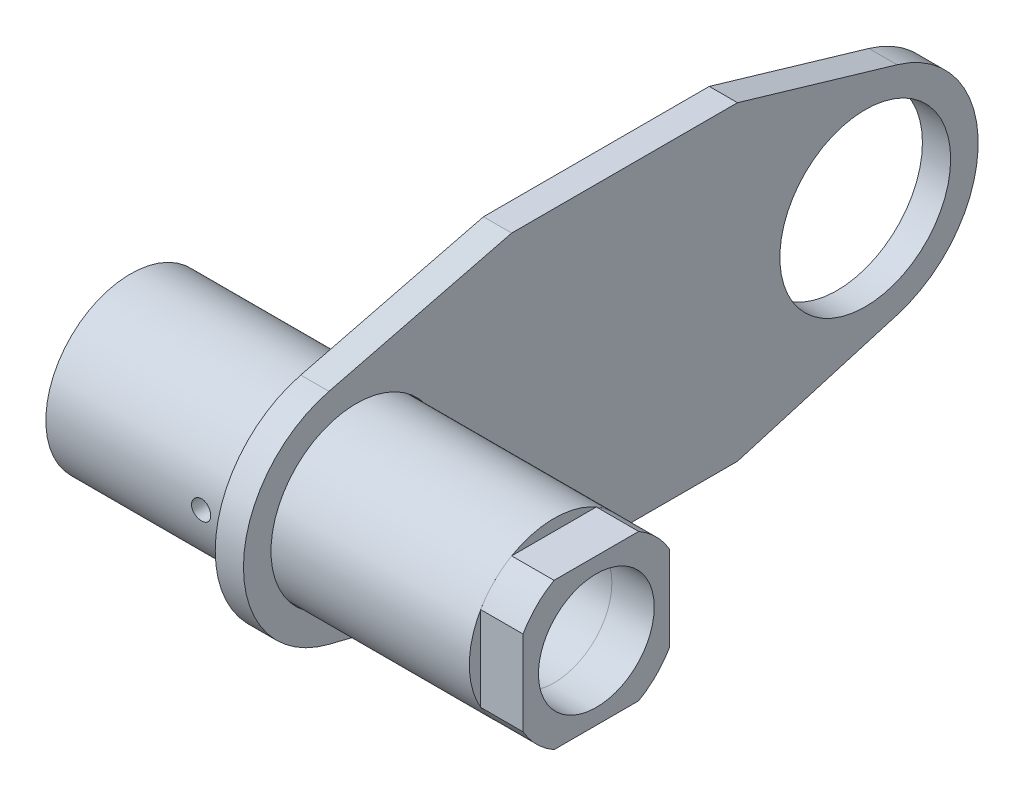
ISO-10303-21;
HEADER;
FILE_DESCRIPTION(('STEP AP214'),'2;1');
FILE_NAME('part.step','',(''),(''),'','','');
FILE_SCHEMA(('AUTOMOTIVE_DESIGN { 1 0 10303 214 1 1 1 1 }'));
ENDSEC;
DATA;
#1=APPLICATION_CONTEXT('core data for automotive mechanical design processes');
#2=APPLICATION_PROTOCOL_DEFINITION('international standard','automotive_design',2000,#1);
#3=PRODUCT_CONTEXT('',#1,'mechanical');
#4=PRODUCT('Part','Part','',(#3));
#5=PRODUCT_RELATED_PRODUCT_CATEGORY('part','',(#4));
#6=PRODUCT_DEFINITION_FORMATION('','',#4);
#7=PRODUCT_DEFINITION_CONTEXT('part definition',#1,'design');
#8=PRODUCT_DEFINITION('design','',#6,#7);
#9=PRODUCT_DEFINITION_SHAPE('','',#8);
#10=(LENGTH_UNIT() NAMED_UNIT(*) SI_UNIT(.MILLI.,.METRE.));
#11=(NAMED_UNIT(*) PLANE_ANGLE_UNIT() SI_UNIT($,.RADIAN.));
#12=(NAMED_UNIT(*) SI_UNIT($,.STERADIAN.) SOLID_ANGLE_UNIT());
#13=UNCERTAINTY_MEASURE_WITH_UNIT(LENGTH_MEASURE(1.E-05),#10,'distance_accuracy_value','');
#14=(GEOMETRIC_REPRESENTATION_CONTEXT(3) GLOBAL_UNCERTAINTY_ASSIGNED_CONTEXT((#13)) GLOBAL_UNIT_ASSIGNED_CONTEXT((#10,
#11,#12)) REPRESENTATION_CONTEXT('',''));
#15=CARTESIAN_POINT('',(0.,0.,0.));
#16=DIRECTION('',(0.,0.,1.));
#17=DIRECTION('',(1.,0.,0.));
#18=AXIS2_PLACEMENT_3D('',#15,#16,#17);
#19=CARTESIAN_POINT('',(-5.00000000000001,-87.1614510293032,-25.6310226888922));
#20=DIRECTION('',(0.,0.959379499066331,0.282118728146921));
#21=DIRECTION('',(0.,-0.282118728146921,0.959379499066331));
#22=AXIS2_PLACEMENT_3D('',#19,#20,#21);
#23=PLANE('',#22);
#24=DIRECTION('',(0.,-0.282118728146921,0.959379499066331));
#25=VECTOR('',#24,1.);
#26=CARTESIAN_POINT('',(4.99999999999999,-87.1614510293032,-25.6310226888922));
#27=LINE('',#26,#25);
#28=CARTESIAN_POINT('',(4.99999999999999,-38.3751799626532,-191.534749125877));
#29=VERTEX_POINT('',#28);
#30=CARTESIAN_POINT('',(4.99999999999999,-55.,-135.));
#31=VERTEX_POINT('',#30);
#32=EDGE_CURVE('E177',#29,#31,#27,.T.);
#33=ORIENTED_EDGE('',*,*,#32,.T.);
#34=DIRECTION('',(1.,0.,0.));
#35=VECTOR('',#34,1.);
#36=CARTESIAN_POINT('',(-5.00000000000001,-55.,-135.));
#37=LINE('',#36,#35);
#38=CARTESIAN_POINT('',(-5.00000000000001,-55.,-135.));
#39=VERTEX_POINT('',#38);
#40=EDGE_CURVE('E15',#39,#31,#37,.T.);
#41=ORIENTED_EDGE('',*,*,#40,.F.);
#42=DIRECTION('',(0.,-0.282118728146921,0.959379499066331));
#43=VECTOR('',#42,1.);
#44=CARTESIAN_POINT('',(-5.00000000000001,-87.1614510293032,-25.6310226888922));
#45=LINE('',#44,#43);
#46=CARTESIAN_POINT('',(-5.00000000000001,-38.3751799626532,-191.534749125877));
#47=VERTEX_POINT('',#46);
#48=EDGE_CURVE('E199',#47,#39,#45,.T.);
#49=ORIENTED_EDGE('',*,*,#48,.F.);
#50=DIRECTION('',(1.,0.,0.));
#51=VECTOR('',#50,1.);
#52=CARTESIAN_POINT('',(-5.00000000000001,-38.3751799626532,-191.534749125877));
#53=LINE('',#52,#51);
#54=EDGE_CURVE('E77',#47,#29,#53,.T.);
#55=ORIENTED_EDGE('',*,*,#54,.T.);
#56=EDGE_LOOP('',(#33,#41,#49,#55));
#57=FACE_BOUND('',#56,.T.);
#58=ADVANCED_FACE('F74',(#57),#23,.F.);
#59=CARTESIAN_POINT('',(-5.00000000000001,-55.,0.));
#60=DIRECTION('',(0.,1.,0.));
#61=DIRECTION('',(0.,0.,1.));
#62=AXIS2_PLACEMENT_3D('',#59,#60,#61);
#63=PLANE('',#62);
#64=DIRECTION('',(0.,0.,1.));
#65=VECTOR('',#64,1.);
#66=CARTESIAN_POINT('',(4.99999999999999,-55.,0.));
#67=LINE('',#66,#65);
#68=CARTESIAN_POINT('',(4.99999999999999,-55.,-55.));
#69=VERTEX_POINT('',#68);
#70=EDGE_CURVE('E117',#31,#69,#67,.T.);
#71=ORIENTED_EDGE('',*,*,#70,.T.);
#72=DIRECTION('',(1.,0.,0.));
#73=VECTOR('',#72,1.);
#74=CARTESIAN_POINT('',(-5.00000000000001,-55.,-55.));
#75=LINE('',#74,#73);
#76=CARTESIAN_POINT('',(-5.00000000000001,-55.,-55.));
#77=VERTEX_POINT('',#76);
#78=EDGE_CURVE('E83',#77,#69,#75,.T.);
#79=ORIENTED_EDGE('',*,*,#78,.F.);
#80=DIRECTION('',(0.,0.,1.));
#81=VECTOR('',#80,1.);
#82=CARTESIAN_POINT('',(-5.00000000000001,-55.,0.));
#83=LINE('',#82,#81);
#84=EDGE_CURVE('E91',#39,#77,#83,.T.);
#85=ORIENTED_EDGE('',*,*,#84,.F.);
#86=ORIENTED_EDGE('',*,*,#40,.T.);
#87=EDGE_LOOP('',(#71,#79,#85,#86));
#88=FACE_BOUND('',#87,.T.);
#89=ADVANCED_FACE('F231',(#88),#63,.F.);
#90=CARTESIAN_POINT('',(-5.00000000000001,-38.8030255711388,9.7121164802297));
#91=DIRECTION('',(0.,0.97007563927847,-0.242802912005743));
#92=DIRECTION('',(0.,0.242802912005743,0.97007563927847));
#93=AXIS2_PLACEMENT_3D('',#90,#91,#92);
#94=PLANE('',#93);
#95=DIRECTION('',(0.,0.242802912005743,0.97007563927847));
#96=VECTOR('',#95,1.);
#97=CARTESIAN_POINT('',(4.99999999999999,-38.8030255711388,9.7121164802297));
#98=LINE('',#97,#96);
#99=CARTESIAN_POINT('',(4.99999999999999,-38.8030255711388,9.71211648022971));
#100=VERTEX_POINT('',#99);
#101=EDGE_CURVE('E156',#69,#100,#98,.T.);
#102=ORIENTED_EDGE('',*,*,#101,.T.);
#103=DIRECTION('',(1.,0.,0.));
#104=VECTOR('',#103,1.);
#105=CARTESIAN_POINT('',(-5.00000000000001,-38.8030255711388,9.71211648022971));
#106=LINE('',#105,#104);
#107=CARTESIAN_POINT('',(-5.00000000000001,-38.8030255711388,9.71211648022971));
#108=VERTEX_POINT('',#107);
#109=EDGE_CURVE('E154',#108,#100,#106,.T.);
#110=ORIENTED_EDGE('',*,*,#109,.F.);
#111=DIRECTION('',(0.,0.242802912005743,0.97007563927847));
#112=VECTOR('',#111,1.);
#113=CARTESIAN_POINT('',(-5.00000000000001,-38.8030255711388,9.7121164802297));
#114=LINE('',#113,#112);
#115=EDGE_CURVE('E145',#77,#108,#114,.T.);
#116=ORIENTED_EDGE('',*,*,#115,.F.);
#117=ORIENTED_EDGE('',*,*,#78,.T.);
#118=EDGE_LOOP('',(#102,#110,#116,#117));
#119=FACE_BOUND('',#118,.T.);
#120=ADVANCED_FACE('F155',(#119),#94,.F.);
#121=CARTESIAN_POINT('',(-5.00000000000001,0.,0.));
#122=DIRECTION('',(1.,0.,0.));
#123=DIRECTION('',(0.,0.,-1.));
#124=AXIS2_PLACEMENT_3D('',#121,#122,#123);
#125=CYLINDRICAL_SURFACE('',#124,40.);
#126=CARTESIAN_POINT('',(4.99999999999999,0.,0.));
#127=DIRECTION('',(1.,0.,0.));
#128=DIRECTION('',(0.,0.,-1.));
#129=AXIS2_PLACEMENT_3D('',#126,#127,#128);
#130=CIRCLE('',#129,40.);
#131=CARTESIAN_POINT('',(4.99999999999999,38.8030255711388,9.71211648022971));
#132=VERTEX_POINT('',#131);
#133=EDGE_CURVE('E190',#132,#100,#130,.T.);
#134=ORIENTED_EDGE('',*,*,#133,.F.);
#135=DIRECTION('',(1.,0.,0.));
#136=VECTOR('',#135,1.);
#137=CARTESIAN_POINT('',(-5.00000000000001,38.8030255711388,9.71211648022971));
#138=LINE('',#137,#136);
#139=CARTESIAN_POINT('',(-5.00000000000001,38.8030255711388,9.71211648022971));
#140=VERTEX_POINT('',#139);
#141=EDGE_CURVE('E160',#140,#132,#138,.T.);
#142=ORIENTED_EDGE('',*,*,#141,.F.);
#143=CARTESIAN_POINT('',(-5.00000000000001,0.,0.));
#144=DIRECTION('',(1.,0.,0.));
#145=DIRECTION('',(0.,0.,-1.));
#146=AXIS2_PLACEMENT_3D('',#143,#144,#145);
#147=CIRCLE('',#146,40.);
#148=EDGE_CURVE('E150',#140,#108,#147,.T.);
#149=ORIENTED_EDGE('',*,*,#148,.T.);
#150=ORIENTED_EDGE('',*,*,#109,.T.);
#151=EDGE_LOOP('',(#134,#142,#149,#150));
#152=FACE_BOUND('',#151,.T.);
#153=ADVANCED_FACE('F162',(#152),#125,.T.);
#154=CARTESIAN_POINT('',(-5.00000000000001,38.8030255711388,9.71211648022971));
#155=DIRECTION('',(0.,-0.97007563927847,-0.242802912005743));
#156=DIRECTION('',(0.,0.242802912005743,-0.97007563927847));
#157=AXIS2_PLACEMENT_3D('',#154,#155,#156);
#158=PLANE('',#157);
#159=DIRECTION('',(0.,0.242802912005743,-0.97007563927847));
#160=VECTOR('',#159,1.);
#161=CARTESIAN_POINT('',(4.99999999999999,38.8030255711388,9.71211648022971));
#162=LINE('',#161,#160);
#163=CARTESIAN_POINT('',(4.99999999999999,55.,-55.));
#164=VERTEX_POINT('',#163);
#165=EDGE_CURVE('E188',#132,#164,#162,.T.);
#166=ORIENTED_EDGE('',*,*,#165,.T.);
#167=DIRECTION('',(1.,0.,0.));
#168=VECTOR('',#167,1.);
#169=CARTESIAN_POINT('',(-5.00000000000001,55.,-55.));
#170=LINE('',#169,#168);
#171=CARTESIAN_POINT('',(-5.00000000000001,55.,-55.));
#172=VERTEX_POINT('',#171);
#173=EDGE_CURVE('E203',#172,#164,#170,.T.);
#174=ORIENTED_EDGE('',*,*,#173,.F.);
#175=DIRECTION('',(0.,0.242802912005743,-0.97007563927847));
#176=VECTOR('',#175,1.);
#177=CARTESIAN_POINT('',(-5.00000000000001,38.8030255711388,9.71211648022971));
#178=LINE('',#177,#176);
#179=EDGE_CURVE('E164',#140,#172,#178,.T.);
#180=ORIENTED_EDGE('',*,*,#179,.F.);
#181=ORIENTED_EDGE('',*,*,#141,.T.);
#182=EDGE_LOOP('',(#166,#174,#180,#181));
#183=FACE_BOUND('',#182,.T.);
#184=ADVANCED_FACE('F243',(#183),#158,.F.);
#185=CARTESIAN_POINT('',(-5.00000000000001,55.,0.));
#186=DIRECTION('',(0.,-1.,0.));
#187=DIRECTION('',(0.,0.,-1.));
#188=AXIS2_PLACEMENT_3D('',#185,#186,#187);
#189=PLANE('',#188);
#190=DIRECTION('',(0.,0.,-1.));
#191=VECTOR('',#190,1.);
#192=CARTESIAN_POINT('',(4.99999999999999,55.,0.));
#193=LINE('',#192,#191);
#194=CARTESIAN_POINT('',(4.99999999999999,55.,-135.));
#195=VERTEX_POINT('',#194);
#196=EDGE_CURVE('E186',#164,#195,#193,.T.);
#197=ORIENTED_EDGE('',*,*,#196,.T.);
#198=DIRECTION('',(1.,0.,0.));
#199=VECTOR('',#198,1.);
#200=CARTESIAN_POINT('',(-5.00000000000001,55.,-135.));
#201=LINE('',#200,#199);
#202=CARTESIAN_POINT('',(-5.00000000000001,55.,-135.));
#203=VERTEX_POINT('',#202);
#204=EDGE_CURVE('E206',#203,#195,#201,.T.);
#205=ORIENTED_EDGE('',*,*,#204,.F.);
#206=DIRECTION('',(0.,0.,-1.));
#207=VECTOR('',#206,1.);
#208=CARTESIAN_POINT('',(-5.00000000000001,55.,0.));
#209=LINE('',#208,#207);
#210=EDGE_CURVE('E166',#172,#203,#209,.T.);
#211=ORIENTED_EDGE('',*,*,#210,.F.);
#212=ORIENTED_EDGE('',*,*,#173,.T.);
#213=EDGE_LOOP('',(#197,#205,#211,#212));
#214=FACE_BOUND('',#213,.T.);
#215=ADVANCED_FACE('F246',(#214),#189,.F.);
#216=CARTESIAN_POINT('',(-5.00000000000001,87.1614510293032,-25.6310226888923));
#217=DIRECTION('',(0.,-0.959379499066331,0.282118728146921));
#218=DIRECTION('',(0.,-0.282118728146921,-0.959379499066331));
#219=AXIS2_PLACEMENT_3D('',#216,#217,#218);
#220=PLANE('',#219);
#221=DIRECTION('',(0.,-0.282118728146921,-0.959379499066331));
#222=VECTOR('',#221,1.);
#223=CARTESIAN_POINT('',(4.99999999999999,87.1614510293032,-25.6310226888923));
#224=LINE('',#223,#222);
#225=CARTESIAN_POINT('',(4.99999999999999,38.3751799626532,-191.534749125877));
#226=VERTEX_POINT('',#225);
#227=EDGE_CURVE('E183',#195,#226,#224,.T.);
#228=ORIENTED_EDGE('',*,*,#227,.T.);
#229=DIRECTION('',(1.,0.,0.));
#230=VECTOR('',#229,1.);
#231=CARTESIAN_POINT('',(-5.00000000000001,38.3751799626532,-191.534749125877));
#232=LINE('',#231,#230);
#233=CARTESIAN_POINT('',(-5.00000000000001,38.3751799626532,-191.534749125877));
#234=VERTEX_POINT('',#233);
#235=EDGE_CURVE('E208',#234,#226,#232,.T.);
#236=ORIENTED_EDGE('',*,*,#235,.F.);
#237=DIRECTION('',(0.,-0.282118728146921,-0.959379499066331));
#238=VECTOR('',#237,1.);
#239=CARTESIAN_POINT('',(-5.00000000000001,87.1614510293032,-25.6310226888923));
#240=LINE('',#239,#238);
#241=EDGE_CURVE('E260',#203,#234,#240,.T.);
#242=ORIENTED_EDGE('',*,*,#241,.F.);
#243=ORIENTED_EDGE('',*,*,#204,.T.);
#244=EDGE_LOOP('',(#228,#236,#242,#243));
#245=FACE_BOUND('',#244,.T.);
#246=ADVANCED_FACE('F226',(#245),#220,.F.);
#247=CARTESIAN_POINT('',(-5.00000000000001,0.,0.));
#248=DIRECTION('',(1.,0.,0.));
#249=DIRECTION('',(0.,0.,-1.));
#250=AXIS2_PLACEMENT_3D('',#247,#248,#249);
#251=CYLINDRICAL_SURFACE('',#250,30.25);
#252=CARTESIAN_POINT('',(-5.00000000000001,0.,0.));
#253=DIRECTION('',(1.,0.,0.));
#254=DIRECTION('',(0.,0.,-1.));
#255=AXIS2_PLACEMENT_3D('',#252,#253,#254);
#256=CIRCLE('',#255,30.25);
#257=CARTESIAN_POINT('',(-5.00000000000001,0.,-30.25));
#258=VERTEX_POINT('',#257);
#259=EDGE_CURVE('E171',#258,#258,#256,.F.);
#260=ORIENTED_EDGE('',*,*,#259,.T.);
#261=EDGE_LOOP('',(#260));
#262=FACE_BOUND('',#261,.T.);
#263=CARTESIAN_POINT('',(4.99999999999999,0.,0.));
#264=DIRECTION('',(1.,0.,0.));
#265=DIRECTION('',(0.,0.,-1.));
#266=AXIS2_PLACEMENT_3D('',#263,#264,#265);
#267=CIRCLE('',#266,30.25);
#268=CARTESIAN_POINT('',(4.99999999999999,0.,-30.25));
#269=VERTEX_POINT('',#268);
#270=EDGE_CURVE('E194',#269,#269,#267,.F.);
#271=ORIENTED_EDGE('',*,*,#270,.F.);
#272=EDGE_LOOP('',(#271));
#273=FACE_BOUND('',#272,.T.);
#274=ADVANCED_FACE('F219',(#262,#273),#251,.F.);
#275=CARTESIAN_POINT('',(-5.00000000000001,0.,-180.25));
#276=DIRECTION('',(1.,0.,0.));
#277=DIRECTION('',(0.,0.,-1.));
#278=AXIS2_PLACEMENT_3D('',#275,#276,#277);
#279=CYLINDRICAL_SURFACE('',#278,40.);
#280=CARTESIAN_POINT('',(4.99999999999999,0.,-180.25));
#281=DIRECTION('',(1.,0.,0.));
#282=DIRECTION('',(0.,0.,-1.));
#283=AXIS2_PLACEMENT_3D('',#280,#281,#282);
#284=CIRCLE('',#283,40.);
#285=EDGE_CURVE('E180',#29,#226,#284,.T.);
#286=ORIENTED_EDGE('',*,*,#285,.F.);
#287=ORIENTED_EDGE('',*,*,#54,.F.);
#288=CARTESIAN_POINT('',(-5.00000000000001,0.,-180.25));
#289=DIRECTION('',(1.,0.,0.));
#290=DIRECTION('',(0.,0.,-1.));
#291=AXIS2_PLACEMENT_3D('',#288,#289,#290);
#292=CIRCLE('',#291,40.);
#293=EDGE_CURVE('E261',#47,#234,#292,.T.);
#294=ORIENTED_EDGE('',*,*,#293,.T.);
#295=ORIENTED_EDGE('',*,*,#235,.T.);
#296=EDGE_LOOP('',(#286,#287,#294,#295));
#297=FACE_BOUND('',#296,.T.);
#298=ADVANCED_FACE('F216',(#297),#279,.T.);
#299=CARTESIAN_POINT('',(-5.00000000000001,0.,-180.25));
#300=DIRECTION('',(1.,0.,0.));
#301=DIRECTION('',(0.,0.,-1.));
#302=AXIS2_PLACEMENT_3D('',#299,#300,#301);
#303=CYLINDRICAL_SURFACE('',#302,30.25);
#304=CARTESIAN_POINT('',(-5.00000000000001,0.,-180.25));
#305=DIRECTION('',(1.,0.,0.));
#306=DIRECTION('',(0.,0.,-1.));
#307=AXIS2_PLACEMENT_3D('',#304,#305,#306);
#308=CIRCLE('',#307,30.25);
#309=CARTESIAN_POINT('',(-5.00000000000001,0.,-210.5));
#310=VERTEX_POINT('',#309);
#311=EDGE_CURVE('E174',#310,#310,#308,.T.);
#312=ORIENTED_EDGE('',*,*,#311,.F.);
#313=EDGE_LOOP('',(#312));
#314=FACE_BOUND('',#313,.T.);
#315=CARTESIAN_POINT('',(4.99999999999999,0.,-180.25));
#316=DIRECTION('',(1.,0.,0.));
#317=DIRECTION('',(0.,0.,-1.));
#318=AXIS2_PLACEMENT_3D('',#315,#316,#317);
#319=CIRCLE('',#318,30.25);
#320=CARTESIAN_POINT('',(4.99999999999999,0.,-210.5));
#321=VERTEX_POINT('',#320);
#322=EDGE_CURVE('E197',#321,#321,#319,.T.);
#323=ORIENTED_EDGE('',*,*,#322,.T.);
#324=EDGE_LOOP('',(#323));
#325=FACE_BOUND('',#324,.T.);
#326=ADVANCED_FACE('F218',(#314,#325),#303,.F.);
#327=CARTESIAN_POINT('',(-5.00000000000001,0.,0.));
#328=DIRECTION('',(1.,0.,0.));
#329=DIRECTION('',(0.,0.,-1.));
#330=AXIS2_PLACEMENT_3D('',#327,#328,#329);
#331=PLANE('',#330);
#332=ORIENTED_EDGE('',*,*,#48,.T.);
#333=ORIENTED_EDGE('',*,*,#84,.T.);
#334=ORIENTED_EDGE('',*,*,#115,.T.);
#335=ORIENTED_EDGE('',*,*,#148,.F.);
#336=ORIENTED_EDGE('',*,*,#179,.T.);
#337=ORIENTED_EDGE('',*,*,#210,.T.);
#338=ORIENTED_EDGE('',*,*,#241,.T.);
#339=ORIENTED_EDGE('',*,*,#293,.F.);
#340=EDGE_LOOP('',(#332,#333,#334,#335,#336,#337,#338,#339));
#341=FACE_BOUND('',#340,.T.);
#342=ORIENTED_EDGE('',*,*,#259,.F.);
#343=EDGE_LOOP('',(#342));
#344=FACE_BOUND('',#343,.T.);
#345=ORIENTED_EDGE('',*,*,#311,.T.);
#346=EDGE_LOOP('',(#345));
#347=FACE_BOUND('',#346,.T.);
#348=ADVANCED_FACE('F147',(#341,#344,#347),#331,.F.);
#349=CARTESIAN_POINT('',(4.99999999999999,0.,0.));
#350=DIRECTION('',(1.,0.,0.));
#351=DIRECTION('',(0.,0.,-1.));
#352=AXIS2_PLACEMENT_3D('',#349,#350,#351);
#353=PLANE('',#352);
#354=ORIENTED_EDGE('',*,*,#32,.F.);
#355=ORIENTED_EDGE('',*,*,#285,.T.);
#356=ORIENTED_EDGE('',*,*,#227,.F.);
#357=ORIENTED_EDGE('',*,*,#196,.F.);
#358=ORIENTED_EDGE('',*,*,#165,.F.);
#359=ORIENTED_EDGE('',*,*,#133,.T.);
#360=ORIENTED_EDGE('',*,*,#101,.F.);
#361=ORIENTED_EDGE('',*,*,#70,.F.);
#362=EDGE_LOOP('',(#354,#355,#356,#357,#358,#359,#360,#361));
#363=FACE_BOUND('',#362,.T.);
#364=ORIENTED_EDGE('',*,*,#270,.T.);
#365=EDGE_LOOP('',(#364));
#366=FACE_BOUND('',#365,.T.);
#367=ORIENTED_EDGE('',*,*,#322,.F.);
#368=EDGE_LOOP('',(#367));
#369=FACE_BOUND('',#368,.T.);
#370=ADVANCED_FACE('F213',(#363,#366,#369),#353,.T.);
#371=CLOSED_SHELL('',(#58,#89,#120,#153,#184,#215,#246,#274,#298,#326,#348,#370));
#372=MANIFOLD_SOLID_BREP('B2',#371);
#373=CARTESIAN_POINT('',(90.,0.,0.));
#374=DIRECTION('',(-1.,0.,0.));
#375=DIRECTION('',(0.,0.,1.));
#376=AXIS2_PLACEMENT_3D('',#373,#374,#375);
#377=CYLINDRICAL_SURFACE('',#376,30.);
#378=CARTESIAN_POINT('',(75.,0.,0.));
#379=DIRECTION('',(1.,0.,0.));
#380=DIRECTION('',(0.,0.,-1.));
#381=AXIS2_PLACEMENT_3D('',#378,#379,#380);
#382=CIRCLE('',#381,30.);
#383=CARTESIAN_POINT('',(75.,-25.9807621135332,-15.));
#384=VERTEX_POINT('',#383);
#385=CARTESIAN_POINT('',(75.,-15.,-25.9807621135332));
#386=VERTEX_POINT('',#385);
#387=EDGE_CURVE('E490',#384,#386,#382,.T.);
#388=ORIENTED_EDGE('',*,*,#387,.T.);
#389=DIRECTION('',(-1.,0.,0.));
#390=VECTOR('',#389,1.);
#391=CARTESIAN_POINT('',(90.,-15.,-25.9807621135332));
#392=LINE('',#391,#390);
#393=CARTESIAN_POINT('',(90.,-15.,-25.9807621135332));
#394=VERTEX_POINT('',#393);
#395=EDGE_CURVE('E72',#394,#386,#392,.T.);
#396=ORIENTED_EDGE('',*,*,#395,.F.);
#397=CARTESIAN_POINT('',(90.,0.,0.));
#398=DIRECTION('',(1.,0.,0.));
#399=DIRECTION('',(0.,0.,-1.));
#400=AXIS2_PLACEMENT_3D('',#397,#398,#399);
#401=CIRCLE('',#400,30.);
#402=CARTESIAN_POINT('',(90.,-25.9807621135332,-15.));
#403=VERTEX_POINT('',#402);
#404=EDGE_CURVE('E470',#403,#394,#401,.T.);
#405=ORIENTED_EDGE('',*,*,#404,.F.);
#406=DIRECTION('',(-1.,0.,0.));
#407=VECTOR('',#406,1.);
#408=CARTESIAN_POINT('',(90.,-25.9807621135332,-15.));
#409=LINE('',#408,#407);
#410=EDGE_CURVE('E471',#403,#384,#409,.T.);
#411=ORIENTED_EDGE('',*,*,#410,.T.);
#412=EDGE_LOOP('',(#388,#396,#405,#411));
#413=FACE_BOUND('',#412,.T.);
#414=ADVANCED_FACE('F376',(#413),#377,.T.);
#415=CARTESIAN_POINT('',(90.,0.,-25.9807621135332));
#416=DIRECTION('',(0.,0.,1.));
#417=DIRECTION('',(1.,0.,0.));
#418=AXIS2_PLACEMENT_3D('',#415,#416,#417);
#419=PLANE('',#418);
#420=DIRECTION('',(0.,1.,0.));
#421=VECTOR('',#420,1.);
#422=CARTESIAN_POINT('',(75.,0.,-25.9807621135332));
#423=LINE('',#422,#421);
#424=CARTESIAN_POINT('',(75.,15.,-25.9807621135332));
#425=VERTEX_POINT('',#424);
#426=EDGE_CURVE('E493',#386,#425,#423,.T.);
#427=ORIENTED_EDGE('',*,*,#426,.T.);
#428=DIRECTION('',(-1.,0.,0.));
#429=VECTOR('',#428,1.);
#430=CARTESIAN_POINT('',(90.,15.,-25.9807621135332));
#431=LINE('',#430,#429);
#432=CARTESIAN_POINT('',(90.,15.,-25.9807621135332));
#433=VERTEX_POINT('',#432);
#434=EDGE_CURVE('E385',#433,#425,#431,.T.);
#435=ORIENTED_EDGE('',*,*,#434,.F.);
#436=DIRECTION('',(0.,1.,0.));
#437=VECTOR('',#436,1.);
#438=CARTESIAN_POINT('',(90.,0.,-25.9807621135332));
#439=LINE('',#438,#437);
#440=EDGE_CURVE('E436',#394,#433,#439,.T.);
#441=ORIENTED_EDGE('',*,*,#440,.F.);
#442=ORIENTED_EDGE('',*,*,#395,.T.);
#443=EDGE_LOOP('',(#427,#435,#441,#442));
#444=FACE_BOUND('',#443,.T.);
#445=ADVANCED_FACE('F534',(#444),#419,.F.);
#446=CARTESIAN_POINT('',(75.,25.9807621135332,-15.));
#447=VERTEX_POINT('',#446);
#448=EDGE_CURVE('E494',#425,#447,#382,.T.);
#449=ORIENTED_EDGE('',*,*,#448,.T.);
#450=DIRECTION('',(-1.,0.,0.));
#451=VECTOR('',#450,1.);
#452=CARTESIAN_POINT('',(90.,25.9807621135332,-15.));
#453=LINE('',#452,#451);
#454=CARTESIAN_POINT('',(90.,25.9807621135332,-15.));
#455=VERTEX_POINT('',#454);
#456=EDGE_CURVE('E507',#455,#447,#453,.T.);
#457=ORIENTED_EDGE('',*,*,#456,.F.);
#458=EDGE_CURVE('E476',#433,#455,#401,.T.);
#459=ORIENTED_EDGE('',*,*,#458,.F.);
#460=ORIENTED_EDGE('',*,*,#434,.T.);
#461=EDGE_LOOP('',(#449,#457,#459,#460));
#462=FACE_BOUND('',#461,.T.);
#463=ADVANCED_FACE('F512',(#462),#377,.T.);
#464=CARTESIAN_POINT('',(90.,25.9807621135332,0.));
#465=DIRECTION('',(0.,1.,0.));
#466=DIRECTION('',(0.,0.,1.));
#467=AXIS2_PLACEMENT_3D('',#464,#465,#466);
#468=PLANE('',#467);
#469=DIRECTION('',(0.,0.,-1.));
#470=VECTOR('',#469,1.);
#471=CARTESIAN_POINT('',(75.,25.9807621135332,0.));
#472=LINE('',#471,#470);
#473=CARTESIAN_POINT('',(75.,25.9807621135332,15.));
#474=VERTEX_POINT('',#473);
#475=EDGE_CURVE('E496',#474,#447,#472,.T.);
#476=ORIENTED_EDGE('',*,*,#475,.F.);
#477=DIRECTION('',(-1.,0.,0.));
#478=VECTOR('',#477,1.);
#479=CARTESIAN_POINT('',(90.,25.9807621135332,15.));
#480=LINE('',#479,#478);
#481=CARTESIAN_POINT('',(90.,25.9807621135332,15.));
#482=VERTEX_POINT('',#481);
#483=EDGE_CURVE('E505',#482,#474,#480,.T.);
#484=ORIENTED_EDGE('',*,*,#483,.F.);
#485=DIRECTION('',(0.,0.,-1.));
#486=VECTOR('',#485,1.);
#487=CARTESIAN_POINT('',(90.,25.9807621135332,0.));
#488=LINE('',#487,#486);
#489=EDGE_CURVE('E475',#482,#455,#488,.T.);
#490=ORIENTED_EDGE('',*,*,#489,.T.);
#491=ORIENTED_EDGE('',*,*,#456,.T.);
#492=EDGE_LOOP('',(#476,#484,#490,#491));
#493=FACE_BOUND('',#492,.T.);
#494=ADVANCED_FACE('F540',(#493),#468,.T.);
#495=CARTESIAN_POINT('',(75.,15.,25.9807621135332));
#496=VERTEX_POINT('',#495);
#497=EDGE_CURVE('E499',#474,#496,#382,.T.);
#498=ORIENTED_EDGE('',*,*,#497,.T.);
#499=DIRECTION('',(-1.,0.,0.));
#500=VECTOR('',#499,1.);
#501=CARTESIAN_POINT('',(90.,15.,25.9807621135332));
#502=LINE('',#501,#500);
#503=CARTESIAN_POINT('',(90.,15.,25.9807621135332));
#504=VERTEX_POINT('',#503);
#505=EDGE_CURVE('E465',#504,#496,#502,.T.);
#506=ORIENTED_EDGE('',*,*,#505,.F.);
#507=EDGE_CURVE('E456',#482,#504,#401,.T.);
#508=ORIENTED_EDGE('',*,*,#507,.F.);
#509=ORIENTED_EDGE('',*,*,#483,.T.);
#510=EDGE_LOOP('',(#498,#506,#508,#509));
#511=FACE_BOUND('',#510,.T.);
#512=ADVANCED_FACE('F519',(#511),#377,.T.);
#513=CARTESIAN_POINT('',(90.,0.,25.9807621135332));
#514=DIRECTION('',(0.,0.,-1.));
#515=DIRECTION('',(-1.,0.,0.));
#516=AXIS2_PLACEMENT_3D('',#513,#514,#515);
#517=PLANE('',#516);
#518=DIRECTION('',(0.,-1.,0.));
#519=VECTOR('',#518,1.);
#520=CARTESIAN_POINT('',(75.,0.,25.9807621135332));
#521=LINE('',#520,#519);
#522=CARTESIAN_POINT('',(75.,-15.,25.9807621135332));
#523=VERTEX_POINT('',#522);
#524=EDGE_CURVE('E464',#496,#523,#521,.T.);
#525=ORIENTED_EDGE('',*,*,#524,.T.);
#526=DIRECTION('',(-1.,0.,0.));
#527=VECTOR('',#526,1.);
#528=CARTESIAN_POINT('',(90.,-15.,25.9807621135332));
#529=LINE('',#528,#527);
#530=CARTESIAN_POINT('',(90.,-15.,25.9807621135332));
#531=VERTEX_POINT('',#530);
#532=EDGE_CURVE('E461',#531,#523,#529,.T.);
#533=ORIENTED_EDGE('',*,*,#532,.F.);
#534=DIRECTION('',(0.,-1.,0.));
#535=VECTOR('',#534,1.);
#536=CARTESIAN_POINT('',(90.,0.,25.9807621135332));
#537=LINE('',#536,#535);
#538=EDGE_CURVE('E449',#504,#531,#537,.T.);
#539=ORIENTED_EDGE('',*,*,#538,.F.);
#540=ORIENTED_EDGE('',*,*,#505,.T.);
#541=EDGE_LOOP('',(#525,#533,#539,#540));
#542=FACE_BOUND('',#541,.T.);
#543=ADVANCED_FACE('F462',(#542),#517,.F.);
#544=CARTESIAN_POINT('',(75.,-25.9807621135332,15.));
#545=VERTEX_POINT('',#544);
#546=EDGE_CURVE('E422',#523,#545,#382,.T.);
#547=ORIENTED_EDGE('',*,*,#546,.T.);
#548=DIRECTION('',(-1.,0.,0.));
#549=VECTOR('',#548,1.);
#550=CARTESIAN_POINT('',(90.,-25.9807621135332,15.));
#551=LINE('',#550,#549);
#552=CARTESIAN_POINT('',(90.,-25.9807621135332,15.));
#553=VERTEX_POINT('',#552);
#554=EDGE_CURVE('E466',#553,#545,#551,.T.);
#555=ORIENTED_EDGE('',*,*,#554,.F.);
#556=EDGE_CURVE('E453',#531,#553,#401,.T.);
#557=ORIENTED_EDGE('',*,*,#556,.F.);
#558=ORIENTED_EDGE('',*,*,#532,.T.);
#559=EDGE_LOOP('',(#547,#555,#557,#558));
#560=FACE_BOUND('',#559,.T.);
#561=ADVANCED_FACE('F468',(#560),#377,.T.);
#562=CARTESIAN_POINT('',(90.,0.,0.));
#563=DIRECTION('',(-1.,0.,0.));
#564=DIRECTION('',(0.,0.,1.));
#565=AXIS2_PLACEMENT_3D('',#562,#563,#564);
#566=CYLINDRICAL_SURFACE('',#565,20.5);
#567=CARTESIAN_POINT('',(90.,0.,0.));
#568=DIRECTION('',(1.,0.,0.));
#569=DIRECTION('',(0.,0.,-1.));
#570=AXIS2_PLACEMENT_3D('',#567,#568,#569);
#571=CIRCLE('',#570,20.5);
#572=CARTESIAN_POINT('',(90.,0.,-20.5));
#573=VERTEX_POINT('',#572);
#574=EDGE_CURVE('E477',#573,#573,#571,.F.);
#575=ORIENTED_EDGE('',*,*,#574,.F.);
#576=EDGE_LOOP('',(#575));
#577=FACE_BOUND('',#576,.T.);
#578=CARTESIAN_POINT('',(75.,0.,0.));
#579=DIRECTION('',(1.,0.,0.));
#580=DIRECTION('',(0.,0.,-1.));
#581=AXIS2_PLACEMENT_3D('',#578,#579,#580);
#582=CIRCLE('',#581,20.5);
#583=CARTESIAN_POINT('',(75.,0.,-20.5));
#584=VERTEX_POINT('',#583);
#585=EDGE_CURVE('E487',#584,#584,#582,.F.);
#586=ORIENTED_EDGE('',*,*,#585,.T.);
#587=EDGE_LOOP('',(#586));
#588=FACE_BOUND('',#587,.T.);
#589=ADVANCED_FACE('F378',(#577,#588),#566,.F.);
#590=CARTESIAN_POINT('',(90.,-25.9807621135332,0.));
#591=DIRECTION('',(0.,1.,0.));
#592=DIRECTION('',(0.,0.,1.));
#593=AXIS2_PLACEMENT_3D('',#590,#591,#592);
#594=PLANE('',#593);
#595=DIRECTION('',(0.,0.,-1.));
#596=VECTOR('',#595,1.);
#597=CARTESIAN_POINT('',(75.,-25.9807621135332,0.));
#598=LINE('',#597,#596);
#599=EDGE_CURVE('E428',#545,#384,#598,.T.);
#600=ORIENTED_EDGE('',*,*,#599,.T.);
#601=ORIENTED_EDGE('',*,*,#410,.F.);
#602=DIRECTION('',(0.,0.,-1.));
#603=VECTOR('',#602,1.);
#604=CARTESIAN_POINT('',(90.,-25.9807621135332,0.));
#605=LINE('',#604,#603);
#606=EDGE_CURVE('E393',#553,#403,#605,.T.);
#607=ORIENTED_EDGE('',*,*,#606,.F.);
#608=ORIENTED_EDGE('',*,*,#554,.T.);
#609=EDGE_LOOP('',(#600,#601,#607,#608));
#610=FACE_BOUND('',#609,.T.);
#611=ADVANCED_FACE('F521',(#610),#594,.F.);
#612=CARTESIAN_POINT('',(90.,0.,0.));
#613=DIRECTION('',(1.,0.,0.));
#614=DIRECTION('',(0.,0.,-1.));
#615=AXIS2_PLACEMENT_3D('',#612,#613,#614);
#616=PLANE('',#615);
#617=ORIENTED_EDGE('',*,*,#574,.T.);
#618=EDGE_LOOP('',(#617));
#619=FACE_BOUND('',#618,.T.);
#620=ORIENTED_EDGE('',*,*,#404,.T.);
#621=ORIENTED_EDGE('',*,*,#440,.T.);
#622=ORIENTED_EDGE('',*,*,#458,.T.);
#623=ORIENTED_EDGE('',*,*,#489,.F.);
#624=ORIENTED_EDGE('',*,*,#507,.T.);
#625=ORIENTED_EDGE('',*,*,#538,.T.);
#626=ORIENTED_EDGE('',*,*,#556,.T.);
#627=ORIENTED_EDGE('',*,*,#606,.T.);
#628=EDGE_LOOP('',(#620,#621,#622,#623,#624,#625,#626,#627));
#629=FACE_BOUND('',#628,.T.);
#630=ADVANCED_FACE('F451',(#619,#629),#616,.T.);
#631=CARTESIAN_POINT('',(75.,0.,0.));
#632=DIRECTION('',(1.,0.,0.));
#633=DIRECTION('',(0.,0.,-1.));
#634=AXIS2_PLACEMENT_3D('',#631,#632,#633);
#635=PLANE('',#634);
#636=ORIENTED_EDGE('',*,*,#585,.F.);
#637=EDGE_LOOP('',(#636));
#638=FACE_BOUND('',#637,.T.);
#639=ORIENTED_EDGE('',*,*,#387,.F.);
#640=ORIENTED_EDGE('',*,*,#599,.F.);
#641=ORIENTED_EDGE('',*,*,#546,.F.);
#642=ORIENTED_EDGE('',*,*,#524,.F.);
#643=ORIENTED_EDGE('',*,*,#497,.F.);
#644=ORIENTED_EDGE('',*,*,#475,.T.);
#645=ORIENTED_EDGE('',*,*,#448,.F.);
#646=ORIENTED_EDGE('',*,*,#426,.F.);
#647=EDGE_LOOP('',(#639,#640,#641,#642,#643,#644,#645,#646));
#648=FACE_BOUND('',#647,.T.);
#649=ADVANCED_FACE('F515',(#638,#648),#635,.F.);
#650=CLOSED_SHELL('',(#414,#445,#463,#494,#512,#543,#561,#589,#611,#630,#649));
#651=MANIFOLD_SOLID_BREP('B9',#650);
#652=CARTESIAN_POINT('',(75.,0.,0.));
#653=DIRECTION('',(-1.,0.,0.));
#654=DIRECTION('',(0.,0.,1.));
#655=AXIS2_PLACEMENT_3D('',#652,#653,#654);
#656=CYLINDRICAL_SURFACE('',#655,20.5);
#657=CARTESIAN_POINT('',(-16.6,0.,20.5));
#658=CARTESIAN_POINT('',(-16.6000076133871,-0.189585189566415,20.4999967607409));
#659=CARTESIAN_POINT('',(-16.6159105683785,-0.379274180285721,20.4973426551542));
#660=CARTESIAN_POINT('',(-16.6790762853598,-0.753332901644163,20.4870104733905));
#661=CARTESIAN_POINT('',(-16.7263679713661,-0.937697562368585,20.4793277635571));
#662=CARTESIAN_POINT('',(-16.8508447529632,-1.29564156342884,20.4598001748105));
#663=CARTESIAN_POINT('',(-16.9280054901075,-1.46922955871363,20.4479586881404));
#664=CARTESIAN_POINT('',(-17.109966505534,-1.80097258696713,20.4214158840039));
#665=CARTESIAN_POINT('',(-17.214763588212,-1.95912940135611,20.4067148972344));
#666=CARTESIAN_POINT('',(-17.4500783910687,-2.25704083027047,20.3759273757801));
#667=CARTESIAN_POINT('',(-17.5808066022304,-2.396628095009,20.3598301527902));
#668=CARTESIAN_POINT('',(-17.8638197150216,-2.65199256918017,20.3281463196385));
#669=CARTESIAN_POINT('',(-18.0161059701204,-2.76776828254216,20.3125597416122));
#670=CARTESIAN_POINT('',(-18.3390605891587,-2.97289287113048,20.2835584274725));
#671=CARTESIAN_POINT('',(-18.5098352915046,-3.06207644669546,20.2701575015792));
#672=CARTESIAN_POINT('',(-18.8642008249565,-3.21042813147772,20.247192934549));
#673=CARTESIAN_POINT('',(-19.04779079807,-3.2695982479311,20.237629036809));
#674=CARTESIAN_POINT('',(-19.4208022197366,-3.35571651690006,20.2235276949299));
#675=CARTESIAN_POINT('',(-19.6101552604749,-3.38295345884316,20.218945228912));
#676=CARTESIAN_POINT('',(-19.9907951182439,-3.405327575443,20.2151893692139));
#677=CARTESIAN_POINT('',(-20.1820817988115,-3.40046699975104,20.216015596449));
#678=CARTESIAN_POINT('',(-20.5590985641591,-3.35901932308546,20.2229426620489));
#679=CARTESIAN_POINT('',(-20.7448654329291,-3.32275649580265,20.2289895872432));
#680=CARTESIAN_POINT('',(-21.1076412710466,-3.22004251623981,20.2455923271754));
#681=CARTESIAN_POINT('',(-21.2846499424627,-3.15359033777739,20.2561482951819));
#682=CARTESIAN_POINT('',(-21.625856342217,-2.9920547864669,20.2806380332024));
#683=CARTESIAN_POINT('',(-21.7899890723191,-2.89683662018763,20.2945876440893));
#684=CARTESIAN_POINT('',(-22.1000701806055,-2.68056770527557,20.3242818749874));
#685=CARTESIAN_POINT('',(-22.2460171036079,-2.55951489151982,20.3400266384493));
#686=CARTESIAN_POINT('',(-22.5174608622452,-2.29324545275891,20.3717740916488));
#687=CARTESIAN_POINT('',(-22.6426848184765,-2.14775057666471,20.3877775758069));
#688=CARTESIAN_POINT('',(-22.8669825641629,-1.83766851455867,20.4180606667741));
#689=CARTESIAN_POINT('',(-22.9660561881551,-1.67308120775136,20.4323402626751));
#690=CARTESIAN_POINT('',(-23.1352652152365,-1.3292307598346,20.4575866486038));
#691=CARTESIAN_POINT('',(-23.2053766678555,-1.14995561872652,20.4685506948151));
#692=CARTESIAN_POINT('',(-23.3144187177679,-0.781952280418173,20.4859085481081));
#693=CARTESIAN_POINT('',(-23.3533518978003,-0.593224867599629,20.4923027337424));
#694=CARTESIAN_POINT('',(-23.3985626709329,-0.214026394976804,20.4997495495966));
#695=CARTESIAN_POINT('',(-23.4052148999782,-0.0236011631634237,20.5008634564578));
#696=CARTESIAN_POINT('',(-23.3866735083907,0.355643100942498,20.4977919867605));
#697=CARTESIAN_POINT('',(-23.3614811007545,0.54446219413879,20.4936068120496));
#698=CARTESIAN_POINT('',(-23.2802771492395,0.913978267219983,20.4804453716466));
#699=CARTESIAN_POINT('',(-23.2244509293388,1.09471708858067,20.4714979257332));
#700=CARTESIAN_POINT('',(-23.0837615081766,1.4442700803044,20.4498112440155));
#701=CARTESIAN_POINT('',(-22.9988966895163,1.61308358581637,20.4370717970086));
#702=CARTESIAN_POINT('',(-22.8016799702134,1.93562225438735,20.4090625297712));
#703=CARTESIAN_POINT('',(-22.6890938666653,2.08920233892381,20.3937715274203));
#704=CARTESIAN_POINT('',(-22.4399528558016,2.37542303387674,20.3624196623849));
#705=CARTESIAN_POINT('',(-22.30339622548,2.50806213774898,20.3463587444191));
#706=CARTESIAN_POINT('',(-22.0085109058219,2.75002312086281,20.3150792745964));
#707=CARTESIAN_POINT('',(-21.8499733392086,2.85909197991855,20.299871048138));
#708=CARTESIAN_POINT('',(-21.5166067272792,3.04904974622276,20.2722112422556));
#709=CARTESIAN_POINT('',(-21.3417781949428,3.12993954041108,20.2597595760729));
#710=CARTESIAN_POINT('',(-20.9815022524511,3.26086390026965,20.2391000523737));
#711=CARTESIAN_POINT('',(-20.7961017823535,3.31102477366771,20.2308748452844));
#712=CARTESIAN_POINT('',(-20.4193591178564,3.37946510385607,20.2195558729327));
#713=CARTESIAN_POINT('',(-20.2280174359417,3.3977473027468,20.2164616663194));
#714=CARTESIAN_POINT('',(-19.8473501907057,3.4018354209687,20.2157739248499));
#715=CARTESIAN_POINT('',(-19.6580289081318,3.38803958545507,20.2181129368401));
#716=CARTESIAN_POINT('',(-19.2844409295987,3.32922399102502,20.2278803148748));
#717=CARTESIAN_POINT('',(-19.1001742177159,3.28420433048647,20.2353086648842));
#718=CARTESIAN_POINT('',(-18.7420778178424,3.16437099731113,20.2543922022976));
#719=CARTESIAN_POINT('',(-18.5682364926492,3.08959128409388,20.2660425705749));
#720=CARTESIAN_POINT('',(-18.2355026268637,2.91240141703405,20.292262172835));
#721=CARTESIAN_POINT('',(-18.0766108163681,2.80998991466771,20.3068315492662));
#722=CARTESIAN_POINT('',(-17.7762737200645,2.57902096199039,20.3374615647257));
#723=CARTESIAN_POINT('',(-17.6350553754541,2.45017042753701,20.3535377150135));
#724=CARTESIAN_POINT('',(-17.3761081361822,2.17059904224454,20.3852458884317));
#725=CARTESIAN_POINT('',(-17.2583846715089,2.01987314958088,20.4008778081802));
#726=CARTESIAN_POINT('',(-17.0490346701321,1.69960628482677,20.4300598937779));
#727=CARTESIAN_POINT('',(-16.9575919266198,1.52994380095415,20.4435951071065));
#728=CARTESIAN_POINT('',(-16.8046451740506,1.17751148478599,20.4669131534425));
#729=CARTESIAN_POINT('',(-16.7431112869836,0.994754943383194,20.4766997291407));
#730=CARTESIAN_POINT('',(-16.6651156550789,0.67606885547097,20.4892771671513));
#731=CARTESIAN_POINT('',(-16.6407363009234,0.542069229601955,20.4932767791585));
#732=CARTESIAN_POINT('',(-16.6081758787347,0.272064200530069,20.4986393355893));
#733=CARTESIAN_POINT('',(-16.5999945361315,0.136058831365612,20.5000023247059));
#734=CARTESIAN_POINT('',(-16.6,0.,20.5));
#735=B_SPLINE_CURVE_WITH_KNOTS('',3,(#657,#658,#659,#660,#661,#662,#663,#664,#665,#666,#667,
#668,#669,#670,#671,#672,#673,#674,#675,#676,#677,#678,#679,#680,#681,#682,#683,#684,#685,#686,
#687,#688,#689,#690,#691,#692,#693,#694,#695,#696,#697,#698,#699,#700,#701,#702,#703,#704,#705,
#706,#707,#708,#709,#710,#711,#712,#713,#714,#715,#716,#717,#718,#719,#720,#721,#722,#723,#724,
#725,#726,#727,#728,#729,#730,#731,#732,#733,#734),.UNSPECIFIED.,.T.,.F.,(4,2,2,2,2,2,2,2,2,2,2,
2,2,2,2,2,2,2,2,2,2,2,2,2,2,2,2,2,2,2,2,2,2,2,2,2,2,2,4),(0.,0.568258242173898,1.13704084999849,
1.7053605850062,2.27361463371508,2.84668548264348,3.41979232640193,3.99639075613382,
4.57295061910705,5.1442550968984,5.71551953351775,6.28095424689451,6.8464081817037,
7.41455397195656,7.98274519463379,8.55790774766108,9.13307393986973,9.70871482217924,
10.2843080147387,10.8532049292133,11.4220801744442,11.9875512670869,12.553053860601,
13.1235086993357,13.6940045592729,14.2703498256068,14.8466769497568,15.420618967419,
15.9945116140101,16.561317554666,17.1281217094773,17.6942809258814,18.2604677777487,
18.8333075264714,19.4062795133774,19.9831661295345,20.5594752635275,20.967301756384,
21.3751213361775),.UNSPECIFIED.);
#736=CARTESIAN_POINT('',(-16.6,0.,20.5));
#737=VERTEX_POINT('',#736);
#738=EDGE_CURVE('E664',#737,#737,#735,.T.);
#739=ORIENTED_EDGE('',*,*,#738,.F.);
#740=EDGE_LOOP('',(#739));
#741=FACE_BOUND('',#740,.T.);
#742=CARTESIAN_POINT('',(75.,0.,0.));
#743=DIRECTION('',(1.,0.,0.));
#744=DIRECTION('',(0.,0.,-1.));
#745=AXIS2_PLACEMENT_3D('',#742,#743,#744);
#746=CIRCLE('',#745,20.5);
#747=CARTESIAN_POINT('',(75.,0.,-20.5));
#748=VERTEX_POINT('',#747);
#749=EDGE_CURVE('E653',#748,#748,#746,.T.);
#750=ORIENTED_EDGE('',*,*,#749,.T.);
#751=EDGE_LOOP('',(#750));
#752=FACE_BOUND('',#751,.T.);
#753=CARTESIAN_POINT('',(-75.,0.,0.));
#754=DIRECTION('',(1.,0.,0.));
#755=DIRECTION('',(0.,0.,-1.));
#756=AXIS2_PLACEMENT_3D('',#753,#754,#755);
#757=CIRCLE('',#756,20.5);
#758=CARTESIAN_POINT('',(-75.,0.,-20.5));
#759=VERTEX_POINT('',#758);
#760=EDGE_CURVE('E662',#759,#759,#757,.T.);
#761=ORIENTED_EDGE('',*,*,#760,.F.);
#762=EDGE_LOOP('',(#761));
#763=FACE_BOUND('',#762,.T.);
#764=ADVANCED_FACE('F639',(#741,#752,#763),#656,.F.);
#765=CARTESIAN_POINT('',(75.,0.,0.));
#766=DIRECTION('',(-1.,0.,0.));
#767=DIRECTION('',(0.,0.,1.));
#768=AXIS2_PLACEMENT_3D('',#765,#766,#767);
#769=CYLINDRICAL_SURFACE('',#768,30.);
#770=CARTESIAN_POINT('',(-23.4,0.,30.));
#771=CARTESIAN_POINT('',(-23.3999918330087,0.190324772298745,29.9999975542966));
#772=CARTESIAN_POINT('',(-23.3839651902076,0.380771891362128,29.998169637779));
#773=CARTESIAN_POINT('',(-23.3202792953278,0.756376295786774,29.9910535128264));
#774=CARTESIAN_POINT('',(-23.2725861134906,0.941527684731231,29.9857615929003));
#775=CARTESIAN_POINT('',(-23.1469820135222,1.30104786459089,29.9723142177025));
#776=CARTESIAN_POINT('',(-23.0690904069537,1.4754234640482,29.9641605927748));
#777=CARTESIAN_POINT('',(-22.8853404821905,1.80859127173568,29.9458990566794));
#778=CARTESIAN_POINT('',(-22.7794873372405,1.96738635511646,29.9357915071056));
#779=CARTESIAN_POINT('',(-22.5423016229358,2.26564599106619,29.9147008704349));
#780=CARTESIAN_POINT('',(-22.4108671376818,2.40502926468266,29.9037143883591));
#781=CARTESIAN_POINT('',(-22.1264679666581,2.65980934588659,29.8821318454234));
#782=CARTESIAN_POINT('',(-21.9735022357805,2.77520498846138,29.8715358035466));
#783=CARTESIAN_POINT('',(-21.6498633373861,2.97903016362427,29.8518999491988));
#784=CARTESIAN_POINT('',(-21.4791426735708,3.06738473603042,29.8428644924376));
#785=CARTESIAN_POINT('',(-21.1251679296236,3.21414105650359,29.8274165003855));
#786=CARTESIAN_POINT('',(-20.9419142426086,3.27254374356829,29.8210038828694));
#787=CARTESIAN_POINT('',(-20.568912590902,3.35749418713095,29.8115593431571));
#788=CARTESIAN_POINT('',(-20.3791960135537,3.38417812578925,29.8085129722233));
#789=CARTESIAN_POINT('',(-19.9979547091672,3.40535479868365,29.8061013663989));
#790=CARTESIAN_POINT('',(-19.8064300425757,3.39984860529683,29.8067360088795));
#791=CARTESIAN_POINT('',(-19.4279531915324,3.35691332201374,29.8116015089525));
#792=CARTESIAN_POINT('',(-19.2409838170847,3.31963358663395,29.8158155409731));
#793=CARTESIAN_POINT('',(-18.8759723672886,3.21444216962213,29.827338752426));
#794=CARTESIAN_POINT('',(-18.697930443268,3.146529968939,29.8346479843047));
#795=CARTESIAN_POINT('',(-18.3553599982353,2.9818387349548,29.8515572637009));
#796=CARTESIAN_POINT('',(-18.1908632686824,2.8849941279429,29.8611625050065));
#797=CARTESIAN_POINT('',(-17.8804007979109,2.66523415256737,29.8815773556764));
#798=CARTESIAN_POINT('',(-17.734435754134,2.5423178034561,29.8923870103403));
#799=CARTESIAN_POINT('',(-17.4643126702875,2.27307257035604,29.9140676215855));
#800=CARTESIAN_POINT('',(-17.3402830359217,2.12661482569058,29.9249385780542));
#801=CARTESIAN_POINT('',(-17.1185490564597,1.81488973723729,29.9454592976579));
#802=CARTESIAN_POINT('',(-17.0208447551469,1.64962236216666,29.9551090587619));
#803=CARTESIAN_POINT('',(-16.8545374099813,1.30487529024553,29.972104655928));
#804=CARTESIAN_POINT('',(-16.7859416523428,1.12539204832037,29.9794499150261));
#805=CARTESIAN_POINT('',(-16.6798966340364,0.757353473650896,29.9910033874662));
#806=CARTESIAN_POINT('',(-16.6424461759219,0.568798489983705,29.9952117214131));
#807=CARTESIAN_POINT('',(-16.5999195184183,0.189079924958542,30.0000015999577));
#808=CARTESIAN_POINT('',(-16.5946662842649,-0.00206358932043822,30.0006029768294));
#809=CARTESIAN_POINT('',(-16.6162170940214,-0.382508246371132,29.9981645480398));
#810=CARTESIAN_POINT('',(-16.6430205790634,-0.571809421203678,29.9951248058568));
#811=CARTESIAN_POINT('',(-16.7277769959386,-0.942679091994069,29.9857581875754));
#812=CARTESIAN_POINT('',(-16.7856462652501,-1.12426694963842,29.9794401417192));
#813=CARTESIAN_POINT('',(-16.9308050709183,-1.47515917730014,29.964224943257));
#814=CARTESIAN_POINT('',(-17.0180954414802,-1.64446319885648,29.9553277175219));
#815=CARTESIAN_POINT('',(-17.2200522112771,-1.96677733420417,29.9358982058402));
#816=CARTESIAN_POINT('',(-17.3348340172028,-2.11971471775312,29.9253590944016));
#817=CARTESIAN_POINT('',(-17.5883510726798,-2.40421613589094,29.903848234906));
#818=CARTESIAN_POINT('',(-17.7270870988382,-2.53577947725477,29.8928764728309));
#819=CARTESIAN_POINT('',(-18.025350630029,-2.7744197203903,29.8716764425802));
#820=CARTESIAN_POINT('',(-18.1849718750688,-2.88137983710875,29.8614518714659));
#821=CARTESIAN_POINT('',(-18.5200162405358,-3.06697259711693,29.8429625663126));
#822=CARTESIAN_POINT('',(-18.6954390927789,-3.1456057210581,29.8346977990206));
#823=CARTESIAN_POINT('',(-19.0567185678156,-3.27212012241192,29.821088130688));
#824=CARTESIAN_POINT('',(-19.242551252636,-3.32006903853742,29.8157368113066));
#825=CARTESIAN_POINT('',(-19.6196944230214,-3.3840725991123,29.8085408360866));
#826=CARTESIAN_POINT('',(-19.8110047021472,-3.40012844394486,29.8066960482701));
#827=CARTESIAN_POINT('',(-20.1925112258519,-3.39987073247031,29.806725353557));
#828=CARTESIAN_POINT('',(-20.3827076223076,-3.38374062904843,29.8085783699876));
#829=CARTESIAN_POINT('',(-20.7576688027334,-3.3199554864699,29.8157493700318));
#830=CARTESIAN_POINT('',(-20.9424335831474,-3.2723004266734,29.821067355914));
#831=CARTESIAN_POINT('',(-21.3012736948361,-3.14687223433094,29.8345629094862));
#832=CARTESIAN_POINT('',(-21.4753515564972,-3.06910626338374,29.8427397971682));
#833=CARTESIAN_POINT('',(-21.8080150362657,-2.8856820466696,29.8610330839221));
#834=CARTESIAN_POINT('',(-21.9666005979338,-2.78002369929427,29.8711494900593));
#835=CARTESIAN_POINT('',(-22.2647171779161,-2.54312865338673,29.8922510910509));
#836=CARTESIAN_POINT('',(-22.4041391458606,-2.41175511222081,29.9032407382951));
#837=CARTESIAN_POINT('',(-22.6590332467206,-2.12743923510435,29.9248104973685));
#838=CARTESIAN_POINT('',(-22.7744996831903,-1.97449178353151,29.9353905113046));
#839=CARTESIAN_POINT('',(-22.9785054800378,-1.65082641444749,29.9549849099537));
#840=CARTESIAN_POINT('',(-23.0669587183299,-1.48005394273972,29.9639942487419));
#841=CARTESIAN_POINT('',(-23.213810989123,-1.12607959441054,29.9793795992575));
#842=CARTESIAN_POINT('',(-23.2722432879823,-0.942891731346477,29.9857585242057));
#843=CARTESIAN_POINT('',(-23.343118472808,-0.632258926145816,29.9935942726568));
#844=CARTESIAN_POINT('',(-23.3644191435396,-0.506786805469869,29.995984966949));
#845=CARTESIAN_POINT('',(-23.3928625948305,-0.254227983015385,29.9991886430366));
#846=CARTESIAN_POINT('',(-23.4000054557365,-0.127141290403799,30.0000016337856));
#847=CARTESIAN_POINT('',(-23.4,0.,30.));
#848=B_SPLINE_CURVE_WITH_KNOTS('',3,(#770,#771,#772,#773,#774,#775,#776,#777,#778,#779,#780,
#781,#782,#783,#784,#785,#786,#787,#788,#789,#790,#791,#792,#793,#794,#795,#796,#797,#798,#799,
#800,#801,#802,#803,#804,#805,#806,#807,#808,#809,#810,#811,#812,#813,#814,#815,#816,#817,#818,
#819,#820,#821,#822,#823,#824,#825,#826,#827,#828,#829,#830,#831,#832,#833,#834,#835,#836,#837,
#838,#839,#840,#841,#842,#843,#844,#845,#846,#847),.UNSPECIFIED.,.T.,.F.,(4,2,2,2,2,2,2,2,2,2,2,
2,2,2,2,2,2,2,2,2,2,2,2,2,2,2,2,2,2,2,2,2,2,2,2,2,2,2,4),(0.,0.570509977666145,1.14163222846627,
1.71238985365657,2.28304195520948,2.85601587110361,3.42901760825208,4.00359366146974,
4.57815170051053,5.15023390197261,5.72229704528496,6.29168588940681,6.86108438188727,
7.43178330355339,8.00250369716071,8.5764617143205,9.15042068605905,9.72452324191989,
10.2986037241772,10.8695248020951,11.4404359268782,12.0098172015745,12.5792146218525,
13.1510455629753,13.7228950466098,14.2974053736865,14.8719059520329,15.4451357279992,
16.0183439284821,16.5882942995782,17.1582450438294,17.7280603138087,18.2978776595815,
18.8708140165225,19.4438864576722,20.0187673113204,20.5930097550751,20.9741255999573,
21.3552392819685),.UNSPECIFIED.);
#849=CARTESIAN_POINT('',(-23.4,0.,30.));
#850=VERTEX_POINT('',#849);
#851=EDGE_CURVE('E375',#850,#850,#848,.T.);
#852=ORIENTED_EDGE('',*,*,#851,.T.);
#853=EDGE_LOOP('',(#852));
#854=FACE_BOUND('',#853,.T.);
#855=CARTESIAN_POINT('',(75.,0.,0.));
#856=DIRECTION('',(1.,0.,0.));
#857=DIRECTION('',(0.,0.,-1.));
#858=AXIS2_PLACEMENT_3D('',#855,#856,#857);
#859=CIRCLE('',#858,30.);
#860=CARTESIAN_POINT('',(75.,0.,-30.));
#861=VERTEX_POINT('',#860);
#862=EDGE_CURVE('E649',#861,#861,#859,.T.);
#863=ORIENTED_EDGE('',*,*,#862,.F.);
#864=EDGE_LOOP('',(#863));
#865=FACE_BOUND('',#864,.T.);
#866=CARTESIAN_POINT('',(-75.,0.,0.));
#867=DIRECTION('',(1.,0.,0.));
#868=DIRECTION('',(0.,0.,-1.));
#869=AXIS2_PLACEMENT_3D('',#866,#867,#868);
#870=CIRCLE('',#869,30.);
#871=CARTESIAN_POINT('',(-75.,0.,-30.));
#872=VERTEX_POINT('',#871);
#873=EDGE_CURVE('E658',#872,#872,#870,.T.);
#874=ORIENTED_EDGE('',*,*,#873,.T.);
#875=EDGE_LOOP('',(#874));
#876=FACE_BOUND('',#875,.T.);
#877=ADVANCED_FACE('F668',(#854,#865,#876),#769,.T.);
#878=CARTESIAN_POINT('',(75.,0.,0.));
#879=DIRECTION('',(1.,0.,0.));
#880=DIRECTION('',(0.,0.,-1.));
#881=AXIS2_PLACEMENT_3D('',#878,#879,#880);
#882=PLANE('',#881);
#883=ORIENTED_EDGE('',*,*,#749,.F.);
#884=EDGE_LOOP('',(#883));
#885=FACE_BOUND('',#884,.T.);
#886=ORIENTED_EDGE('',*,*,#862,.T.);
#887=EDGE_LOOP('',(#886));
#888=FACE_BOUND('',#887,.T.);
#889=ADVANCED_FACE('F673',(#885,#888),#882,.T.);
#890=CARTESIAN_POINT('',(-75.,0.,0.));
#891=DIRECTION('',(1.,0.,0.));
#892=DIRECTION('',(0.,0.,-1.));
#893=AXIS2_PLACEMENT_3D('',#890,#891,#892);
#894=PLANE('',#893);
#895=ORIENTED_EDGE('',*,*,#760,.T.);
#896=EDGE_LOOP('',(#895));
#897=FACE_BOUND('',#896,.T.);
#898=ORIENTED_EDGE('',*,*,#873,.F.);
#899=EDGE_LOOP('',(#898));
#900=FACE_BOUND('',#899,.T.);
#901=ADVANCED_FACE('F670',(#897,#900),#894,.F.);
#902=CARTESIAN_POINT('',(-20.,0.,0.));
#903=DIRECTION('',(0.,0.,-1.));
#904=DIRECTION('',(-1.,0.,0.));
#905=AXIS2_PLACEMENT_3D('',#902,#903,#904);
#906=CYLINDRICAL_SURFACE('',#905,3.4);
#907=ORIENTED_EDGE('',*,*,#738,.T.);
#908=EDGE_LOOP('',(#907));
#909=FACE_BOUND('',#908,.T.);
#910=ORIENTED_EDGE('',*,*,#851,.F.);
#911=EDGE_LOOP('',(#910));
#912=FACE_BOUND('',#911,.T.);
#913=ADVANCED_FACE('F672',(#909,#912),#906,.F.);
#914=CLOSED_SHELL('',(#764,#877,#889,#901,#913));
#915=MANIFOLD_SOLID_BREP('B66',#914);
#916=ADVANCED_BREP_SHAPE_REPRESENTATION('',(#18,#372,#651,#915),#14);
#917=SHAPE_DEFINITION_REPRESENTATION(#9,#916);
ENDSEC;
END-ISO-10303-21;
